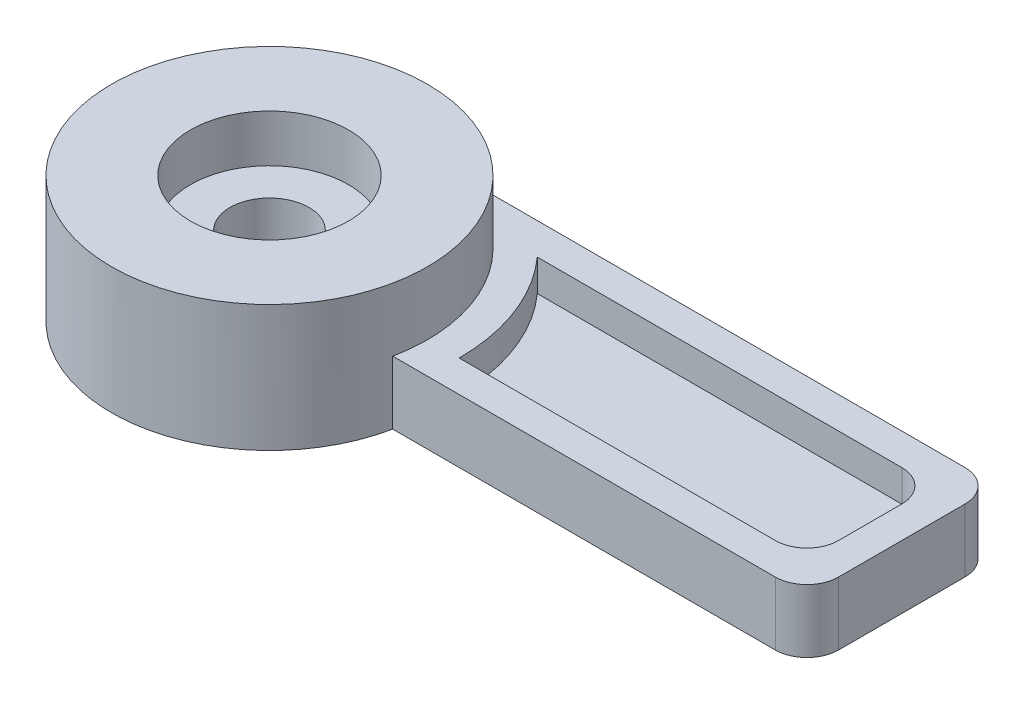
ISO-10303-21;
HEADER;
FILE_DESCRIPTION(('STEP AP214'),'2;1');
FILE_NAME('part.step','',(''),(''),'','','');
FILE_SCHEMA(('AUTOMOTIVE_DESIGN { 1 0 10303 214 1 1 1 1 }'));
ENDSEC;
DATA;
#1=APPLICATION_CONTEXT('core data for automotive mechanical design processes');
#2=APPLICATION_PROTOCOL_DEFINITION('international standard','automotive_design',2000,#1);
#3=PRODUCT_CONTEXT('',#1,'mechanical');
#4=PRODUCT('Part','Part','',(#3));
#5=PRODUCT_RELATED_PRODUCT_CATEGORY('part','',(#4));
#6=PRODUCT_DEFINITION_FORMATION('','',#4);
#7=PRODUCT_DEFINITION_CONTEXT('part definition',#1,'design');
#8=PRODUCT_DEFINITION('design','',#6,#7);
#9=PRODUCT_DEFINITION_SHAPE('','',#8);
#10=(LENGTH_UNIT() NAMED_UNIT(*) SI_UNIT(.MILLI.,.METRE.));
#11=(NAMED_UNIT(*) PLANE_ANGLE_UNIT() SI_UNIT($,.RADIAN.));
#12=(NAMED_UNIT(*) SI_UNIT($,.STERADIAN.) SOLID_ANGLE_UNIT());
#13=UNCERTAINTY_MEASURE_WITH_UNIT(LENGTH_MEASURE(1.E-05),#10,'distance_accuracy_value','');
#14=(GEOMETRIC_REPRESENTATION_CONTEXT(3) GLOBAL_UNCERTAINTY_ASSIGNED_CONTEXT((#13)) GLOBAL_UNIT_ASSIGNED_CONTEXT((#10,
#11,#12)) REPRESENTATION_CONTEXT('',''));
#15=CARTESIAN_POINT('',(0.,0.,0.));
#16=DIRECTION('',(0.,0.,1.));
#17=DIRECTION('',(1.,0.,0.));
#18=AXIS2_PLACEMENT_3D('',#15,#16,#17);
#19=CARTESIAN_POINT('',(0.,20.,0.));
#20=DIRECTION('',(0.,0.,1.));
#21=DIRECTION('',(1.,0.,0.));
#22=AXIS2_PLACEMENT_3D('',#19,#20,#21);
#23=PLANE('',#22);
#24=DIRECTION('',(-1.,0.,0.));
#25=VECTOR('',#24,1.);
#26=CARTESIAN_POINT('',(0.,20.,0.));
#27=LINE('',#26,#25);
#28=CARTESIAN_POINT('',(160.,20.,0.));
#29=VERTEX_POINT('',#28);
#30=CARTESIAN_POINT('',(60.,20.,0.));
#31=VERTEX_POINT('',#30);
#32=EDGE_CURVE('E260',#29,#31,#27,.T.);
#33=ORIENTED_EDGE('',*,*,#32,.F.);
#34=DIRECTION('',(0.,-1.,0.));
#35=VECTOR('',#34,1.);
#36=CARTESIAN_POINT('',(160.,10.,0.));
#37=LINE('',#36,#35);
#38=CARTESIAN_POINT('',(160.,10.,0.));
#39=VERTEX_POINT('',#38);
#40=EDGE_CURVE('E184',#29,#39,#37,.T.);
#41=ORIENTED_EDGE('',*,*,#40,.T.);
#42=DIRECTION('',(-1.,0.,0.));
#43=VECTOR('',#42,1.);
#44=CARTESIAN_POINT('',(170.,10.,0.));
#45=LINE('',#44,#43);
#46=CARTESIAN_POINT('',(60.,10.,0.));
#47=VERTEX_POINT('',#46);
#48=EDGE_CURVE('E276',#39,#47,#45,.T.);
#49=ORIENTED_EDGE('',*,*,#48,.T.);
#50=DIRECTION('',(0.,-1.,0.));
#51=VECTOR('',#50,1.);
#52=CARTESIAN_POINT('',(60.,20.,0.));
#53=LINE('',#52,#51);
#54=EDGE_CURVE('E140',#31,#47,#53,.T.);
#55=ORIENTED_EDGE('',*,*,#54,.F.);
#56=EDGE_LOOP('',(#33,#41,#49,#55));
#57=FACE_BOUND('',#56,.T.);
#58=ADVANCED_FACE('F35',(#57),#23,.F.);
#59=CARTESIAN_POINT('',(0.,20.,0.));
#60=DIRECTION('',(0.,-1.,0.));
#61=DIRECTION('',(0.,0.,-1.));
#62=AXIS2_PLACEMENT_3D('',#59,#60,#61);
#63=CYLINDRICAL_SURFACE('',#62,60.);
#64=ORIENTED_EDGE('',*,*,#54,.T.);
#65=CARTESIAN_POINT('',(0.,10.,0.));
#66=DIRECTION('',(0.,1.,0.));
#67=DIRECTION('',(0.,0.,1.));
#68=AXIS2_PLACEMENT_3D('',#65,#66,#67);
#69=CIRCLE('',#68,60.);
#70=CARTESIAN_POINT('',(44.7213595499958,10.,-40.));
#71=VERTEX_POINT('',#70);
#72=EDGE_CURVE('E126',#47,#71,#69,.T.);
#73=ORIENTED_EDGE('',*,*,#72,.T.);
#74=DIRECTION('',(0.,-1.,0.));
#75=VECTOR('',#74,1.);
#76=CARTESIAN_POINT('',(44.7213595499958,20.,-40.));
#77=LINE('',#76,#75);
#78=CARTESIAN_POINT('',(44.7213595499958,20.,-40.));
#79=VERTEX_POINT('',#78);
#80=EDGE_CURVE('E137',#79,#71,#77,.T.);
#81=ORIENTED_EDGE('',*,*,#80,.F.);
#82=CARTESIAN_POINT('',(0.,20.,0.));
#83=DIRECTION('',(0.,1.,0.));
#84=DIRECTION('',(0.,0.,1.));
#85=AXIS2_PLACEMENT_3D('',#82,#83,#84);
#86=CIRCLE('',#85,60.);
#87=EDGE_CURVE('E267',#31,#79,#86,.T.);
#88=ORIENTED_EDGE('',*,*,#87,.F.);
#89=EDGE_LOOP('',(#64,#73,#81,#88));
#90=FACE_BOUND('',#89,.T.);
#91=ADVANCED_FACE('F135',(#90),#63,.T.);
#92=CARTESIAN_POINT('',(0.,20.,-40.));
#93=DIRECTION('',(0.,0.,-1.));
#94=DIRECTION('',(-1.,0.,0.));
#95=AXIS2_PLACEMENT_3D('',#92,#93,#94);
#96=PLANE('',#95);
#97=DIRECTION('',(1.,0.,0.));
#98=VECTOR('',#97,1.);
#99=CARTESIAN_POINT('',(44.7213595499958,10.,-40.));
#100=LINE('',#99,#98);
#101=CARTESIAN_POINT('',(160.,10.,-40.));
#102=VERTEX_POINT('',#101);
#103=EDGE_CURVE('E122',#71,#102,#100,.T.);
#104=ORIENTED_EDGE('',*,*,#103,.T.);
#105=DIRECTION('',(0.,-1.,0.));
#106=VECTOR('',#105,1.);
#107=CARTESIAN_POINT('',(160.,20.,-40.));
#108=LINE('',#107,#106);
#109=CARTESIAN_POINT('',(160.,20.,-40.));
#110=VERTEX_POINT('',#109);
#111=EDGE_CURVE('E182',#102,#110,#108,.F.);
#112=ORIENTED_EDGE('',*,*,#111,.T.);
#113=DIRECTION('',(1.,0.,0.));
#114=VECTOR('',#113,1.);
#115=CARTESIAN_POINT('',(0.,20.,-40.));
#116=LINE('',#115,#114);
#117=EDGE_CURVE('E145',#79,#110,#116,.T.);
#118=ORIENTED_EDGE('',*,*,#117,.F.);
#119=ORIENTED_EDGE('',*,*,#80,.T.);
#120=EDGE_LOOP('',(#104,#112,#118,#119));
#121=FACE_BOUND('',#120,.T.);
#122=ADVANCED_FACE('F143',(#121),#96,.F.);
#123=CARTESIAN_POINT('',(0.,20.,10.));
#124=DIRECTION('',(0.,0.,1.));
#125=DIRECTION('',(1.,0.,0.));
#126=AXIS2_PLACEMENT_3D('',#123,#124,#125);
#127=PLANE('',#126);
#128=DIRECTION('',(-1.,0.,0.));
#129=VECTOR('',#128,1.);
#130=CARTESIAN_POINT('',(0.,0.,10.));
#131=LINE('',#130,#129);
#132=CARTESIAN_POINT('',(170.,0.,9.99999999999999));
#133=VERTEX_POINT('',#132);
#134=CARTESIAN_POINT('',(48.9897948556636,0.,10.));
#135=VERTEX_POINT('',#134);
#136=EDGE_CURVE('E235',#133,#135,#131,.T.);
#137=ORIENTED_EDGE('',*,*,#136,.F.);
#138=DIRECTION('',(0.,-1.,0.));
#139=VECTOR('',#138,1.);
#140=CARTESIAN_POINT('',(170.,20.,9.99999999999999));
#141=LINE('',#140,#139);
#142=CARTESIAN_POINT('',(170.,20.,9.99999999999999));
#143=VERTEX_POINT('',#142);
#144=EDGE_CURVE('E186',#133,#143,#141,.F.);
#145=ORIENTED_EDGE('',*,*,#144,.T.);
#146=DIRECTION('',(-1.,0.,0.));
#147=VECTOR('',#146,1.);
#148=CARTESIAN_POINT('',(0.,20.,10.));
#149=LINE('',#148,#147);
#150=CARTESIAN_POINT('',(48.9897948556636,20.,10.));
#151=VERTEX_POINT('',#150);
#152=EDGE_CURVE('E253',#143,#151,#149,.T.);
#153=ORIENTED_EDGE('',*,*,#152,.T.);
#154=DIRECTION('',(0.,-1.,0.));
#155=VECTOR('',#154,1.);
#156=CARTESIAN_POINT('',(48.9897948556636,20.,10.));
#157=LINE('',#156,#155);
#158=EDGE_CURVE('E146',#151,#135,#157,.T.);
#159=ORIENTED_EDGE('',*,*,#158,.T.);
#160=EDGE_LOOP('',(#137,#145,#153,#159));
#161=FACE_BOUND('',#160,.T.);
#162=ADVANCED_FACE('F227',(#161),#127,.T.);
#163=CARTESIAN_POINT('',(180.,20.,0.));
#164=DIRECTION('',(1.,0.,0.));
#165=DIRECTION('',(0.,0.,-1.));
#166=AXIS2_PLACEMENT_3D('',#163,#164,#165);
#167=PLANE('',#166);
#168=DIRECTION('',(0.,0.,1.));
#169=VECTOR('',#168,1.);
#170=CARTESIAN_POINT('',(180.,0.,0.));
#171=LINE('',#170,#169);
#172=CARTESIAN_POINT('',(180.,0.,-40.));
#173=VERTEX_POINT('',#172);
#174=CARTESIAN_POINT('',(180.,0.,0.));
#175=VERTEX_POINT('',#174);
#176=EDGE_CURVE('E241',#173,#175,#171,.T.);
#177=ORIENTED_EDGE('',*,*,#176,.F.);
#178=DIRECTION('',(0.,-1.,0.));
#179=VECTOR('',#178,1.);
#180=CARTESIAN_POINT('',(180.,20.,-40.));
#181=LINE('',#180,#179);
#182=CARTESIAN_POINT('',(180.,20.,-40.));
#183=VERTEX_POINT('',#182);
#184=EDGE_CURVE('E169',#173,#183,#181,.F.);
#185=ORIENTED_EDGE('',*,*,#184,.T.);
#186=DIRECTION('',(0.,0.,1.));
#187=VECTOR('',#186,1.);
#188=CARTESIAN_POINT('',(180.,20.,0.));
#189=LINE('',#188,#187);
#190=CARTESIAN_POINT('',(180.,20.,0.));
#191=VERTEX_POINT('',#190);
#192=EDGE_CURVE('E250',#183,#191,#189,.T.);
#193=ORIENTED_EDGE('',*,*,#192,.T.);
#194=DIRECTION('',(0.,-1.,0.));
#195=VECTOR('',#194,1.);
#196=CARTESIAN_POINT('',(180.,20.,0.));
#197=LINE('',#196,#195);
#198=EDGE_CURVE('E166',#191,#175,#197,.T.);
#199=ORIENTED_EDGE('',*,*,#198,.T.);
#200=EDGE_LOOP('',(#177,#185,#193,#199));
#201=FACE_BOUND('',#200,.T.);
#202=ADVANCED_FACE('F223',(#201),#167,.T.);
#203=CARTESIAN_POINT('',(0.,20.,-50.));
#204=DIRECTION('',(0.,0.,-1.));
#205=DIRECTION('',(-1.,0.,0.));
#206=AXIS2_PLACEMENT_3D('',#203,#204,#205);
#207=PLANE('',#206);
#208=DIRECTION('',(1.,0.,0.));
#209=VECTOR('',#208,1.);
#210=CARTESIAN_POINT('',(0.,20.,-50.));
#211=LINE('',#210,#209);
#212=CARTESIAN_POINT('',(0.,20.,-50.));
#213=VERTEX_POINT('',#212);
#214=CARTESIAN_POINT('',(170.,20.,-50.));
#215=VERTEX_POINT('',#214);
#216=EDGE_CURVE('E257',#213,#215,#211,.T.);
#217=ORIENTED_EDGE('',*,*,#216,.T.);
#218=DIRECTION('',(0.,-1.,0.));
#219=VECTOR('',#218,1.);
#220=CARTESIAN_POINT('',(170.,20.,-50.));
#221=LINE('',#220,#219);
#222=CARTESIAN_POINT('',(170.,0.,-50.));
#223=VERTEX_POINT('',#222);
#224=EDGE_CURVE('E148',#215,#223,#221,.T.);
#225=ORIENTED_EDGE('',*,*,#224,.T.);
#226=DIRECTION('',(1.,0.,0.));
#227=VECTOR('',#226,1.);
#228=CARTESIAN_POINT('',(0.,0.,-50.));
#229=LINE('',#228,#227);
#230=CARTESIAN_POINT('',(0.,0.,-50.));
#231=VERTEX_POINT('',#230);
#232=EDGE_CURVE('E154',#231,#223,#229,.T.);
#233=ORIENTED_EDGE('',*,*,#232,.F.);
#234=DIRECTION('',(0.,-1.,0.));
#235=VECTOR('',#234,1.);
#236=CARTESIAN_POINT('',(0.,20.,-50.));
#237=LINE('',#236,#235);
#238=EDGE_CURVE('E151',#213,#231,#237,.T.);
#239=ORIENTED_EDGE('',*,*,#238,.F.);
#240=EDGE_LOOP('',(#217,#225,#233,#239));
#241=FACE_BOUND('',#240,.T.);
#242=ADVANCED_FACE('F220',(#241),#207,.T.);
#243=CARTESIAN_POINT('',(170.,20.,0.));
#244=DIRECTION('',(1.,0.,0.));
#245=DIRECTION('',(0.,0.,-1.));
#246=AXIS2_PLACEMENT_3D('',#243,#244,#245);
#247=PLANE('',#246);
#248=DIRECTION('',(0.,0.,1.));
#249=VECTOR('',#248,1.);
#250=CARTESIAN_POINT('',(170.,20.,0.));
#251=LINE('',#250,#249);
#252=CARTESIAN_POINT('',(170.,20.,-30.));
#253=VERTEX_POINT('',#252);
#254=CARTESIAN_POINT('',(170.,20.,-10.));
#255=VERTEX_POINT('',#254);
#256=EDGE_CURVE('E158',#253,#255,#251,.T.);
#257=ORIENTED_EDGE('',*,*,#256,.F.);
#258=DIRECTION('',(0.,-1.,0.));
#259=VECTOR('',#258,1.);
#260=CARTESIAN_POINT('',(170.,10.,-30.));
#261=LINE('',#260,#259);
#262=CARTESIAN_POINT('',(170.,10.,-30.));
#263=VERTEX_POINT('',#262);
#264=EDGE_CURVE('E177',#253,#263,#261,.T.);
#265=ORIENTED_EDGE('',*,*,#264,.T.);
#266=DIRECTION('',(0.,0.,1.));
#267=VECTOR('',#266,1.);
#268=CARTESIAN_POINT('',(170.,10.,-40.));
#269=LINE('',#268,#267);
#270=CARTESIAN_POINT('',(170.,10.,-10.));
#271=VERTEX_POINT('',#270);
#272=EDGE_CURVE('E131',#263,#271,#269,.T.);
#273=ORIENTED_EDGE('',*,*,#272,.T.);
#274=DIRECTION('',(0.,-1.,0.));
#275=VECTOR('',#274,1.);
#276=CARTESIAN_POINT('',(170.,20.,-10.));
#277=LINE('',#276,#275);
#278=EDGE_CURVE('E175',#271,#255,#277,.F.);
#279=ORIENTED_EDGE('',*,*,#278,.T.);
#280=EDGE_LOOP('',(#257,#265,#273,#279));
#281=FACE_BOUND('',#280,.T.);
#282=ADVANCED_FACE('F196',(#281),#247,.F.);
#283=CARTESIAN_POINT('',(0.,20.,0.));
#284=DIRECTION('',(0.,1.,0.));
#285=DIRECTION('',(0.,0.,1.));
#286=AXIS2_PLACEMENT_3D('',#283,#284,#285);
#287=PLANE('',#286);
#288=ORIENTED_EDGE('',*,*,#192,.F.);
#289=CARTESIAN_POINT('',(170.,20.,-40.));
#290=DIRECTION('',(0.,1.,0.));
#291=DIRECTION('',(0.,0.,1.));
#292=AXIS2_PLACEMENT_3D('',#289,#290,#291);
#293=CIRCLE('',#292,10.);
#294=EDGE_CURVE('E173',#183,#215,#293,.T.);
#295=ORIENTED_EDGE('',*,*,#294,.T.);
#296=ORIENTED_EDGE('',*,*,#216,.F.);
#297=CARTESIAN_POINT('',(0.,20.,0.));
#298=DIRECTION('',(0.,1.,0.));
#299=DIRECTION('',(0.,0.,1.));
#300=AXIS2_PLACEMENT_3D('',#297,#298,#299);
#301=CIRCLE('',#300,50.);
#302=EDGE_CURVE('E262',#151,#213,#301,.T.);
#303=ORIENTED_EDGE('',*,*,#302,.F.);
#304=ORIENTED_EDGE('',*,*,#152,.F.);
#305=CARTESIAN_POINT('',(170.,20.,0.));
#306=DIRECTION('',(0.,1.,0.));
#307=DIRECTION('',(0.,0.,1.));
#308=AXIS2_PLACEMENT_3D('',#305,#306,#307);
#309=CIRCLE('',#308,10.);
#310=EDGE_CURVE('E171',#143,#191,#309,.T.);
#311=ORIENTED_EDGE('',*,*,#310,.T.);
#312=EDGE_LOOP('',(#288,#295,#296,#303,#304,#311));
#313=FACE_BOUND('',#312,.T.);
#314=ORIENTED_EDGE('',*,*,#256,.T.);
#315=CARTESIAN_POINT('',(160.,20.,-10.));
#316=DIRECTION('',(0.,1.,0.));
#317=DIRECTION('',(0.,0.,1.));
#318=AXIS2_PLACEMENT_3D('',#315,#316,#317);
#319=CIRCLE('',#318,10.);
#320=EDGE_CURVE('E11',#255,#29,#319,.F.);
#321=ORIENTED_EDGE('',*,*,#320,.T.);
#322=ORIENTED_EDGE('',*,*,#32,.T.);
#323=ORIENTED_EDGE('',*,*,#87,.T.);
#324=ORIENTED_EDGE('',*,*,#117,.T.);
#325=CARTESIAN_POINT('',(160.,20.,-30.));
#326=DIRECTION('',(0.,1.,0.));
#327=DIRECTION('',(0.,0.,1.));
#328=AXIS2_PLACEMENT_3D('',#325,#326,#327);
#329=CIRCLE('',#328,10.);
#330=EDGE_CURVE('E43',#110,#253,#329,.F.);
#331=ORIENTED_EDGE('',*,*,#330,.T.);
#332=EDGE_LOOP('',(#314,#321,#322,#323,#324,#331));
#333=FACE_BOUND('',#332,.T.);
#334=ADVANCED_FACE('F191',(#313,#333),#287,.T.);
#335=CARTESIAN_POINT('',(0.,0.,0.));
#336=DIRECTION('',(0.,1.,0.));
#337=DIRECTION('',(0.,0.,1.));
#338=AXIS2_PLACEMENT_3D('',#335,#336,#337);
#339=PLANE('',#338);
#340=CARTESIAN_POINT('',(0.,0.,0.));
#341=DIRECTION('',(0.,1.,0.));
#342=DIRECTION('',(0.,0.,1.));
#343=AXIS2_PLACEMENT_3D('',#340,#341,#342);
#344=CIRCLE('',#343,12.5);
#345=CARTESIAN_POINT('',(0.,0.,12.5));
#346=VERTEX_POINT('',#345);
#347=EDGE_CURVE('E141',#346,#346,#344,.T.);
#348=ORIENTED_EDGE('',*,*,#347,.T.);
#349=EDGE_LOOP('',(#348));
#350=FACE_BOUND('',#349,.T.);
#351=ORIENTED_EDGE('',*,*,#232,.T.);
#352=CARTESIAN_POINT('',(170.,0.,-40.));
#353=DIRECTION('',(0.,1.,0.));
#354=DIRECTION('',(0.,0.,1.));
#355=AXIS2_PLACEMENT_3D('',#352,#353,#354);
#356=CIRCLE('',#355,10.);
#357=EDGE_CURVE('E164',#223,#173,#356,.F.);
#358=ORIENTED_EDGE('',*,*,#357,.T.);
#359=ORIENTED_EDGE('',*,*,#176,.T.);
#360=CARTESIAN_POINT('',(170.,0.,0.));
#361=DIRECTION('',(0.,1.,0.));
#362=DIRECTION('',(0.,0.,1.));
#363=AXIS2_PLACEMENT_3D('',#360,#361,#362);
#364=CIRCLE('',#363,10.);
#365=EDGE_CURVE('E162',#175,#133,#364,.F.);
#366=ORIENTED_EDGE('',*,*,#365,.T.);
#367=ORIENTED_EDGE('',*,*,#136,.T.);
#368=CARTESIAN_POINT('',(0.,0.,0.));
#369=DIRECTION('',(0.,1.,0.));
#370=DIRECTION('',(0.,0.,1.));
#371=AXIS2_PLACEMENT_3D('',#368,#369,#370);
#372=CIRCLE('',#371,50.);
#373=EDGE_CURVE('E274',#231,#135,#372,.T.);
#374=ORIENTED_EDGE('',*,*,#373,.F.);
#375=EDGE_LOOP('',(#351,#358,#359,#366,#367,#374));
#376=FACE_BOUND('',#375,.T.);
#377=ADVANCED_FACE('F303',(#350,#376),#339,.F.);
#378=CARTESIAN_POINT('',(0.,40.,0.));
#379=DIRECTION('',(0.,-1.,0.));
#380=DIRECTION('',(0.,0.,-1.));
#381=AXIS2_PLACEMENT_3D('',#378,#379,#380);
#382=CYLINDRICAL_SURFACE('',#381,50.);
#383=ORIENTED_EDGE('',*,*,#158,.F.);
#384=ORIENTED_EDGE('',*,*,#302,.T.);
#385=ORIENTED_EDGE('',*,*,#238,.T.);
#386=ORIENTED_EDGE('',*,*,#373,.T.);
#387=EDGE_LOOP('',(#383,#384,#385,#386));
#388=FACE_BOUND('',#387,.T.);
#389=CARTESIAN_POINT('',(0.,40.,0.));
#390=DIRECTION('',(0.,1.,0.));
#391=DIRECTION('',(0.,0.,1.));
#392=AXIS2_PLACEMENT_3D('',#389,#390,#391);
#393=CIRCLE('',#392,50.);
#394=CARTESIAN_POINT('',(0.,40.,50.));
#395=VERTEX_POINT('',#394);
#396=EDGE_CURVE('E242',#395,#395,#393,.T.);
#397=ORIENTED_EDGE('',*,*,#396,.F.);
#398=EDGE_LOOP('',(#397));
#399=FACE_BOUND('',#398,.T.);
#400=ADVANCED_FACE('F298',(#388,#399),#382,.T.);
#401=CARTESIAN_POINT('',(0.,40.,0.));
#402=DIRECTION('',(0.,1.,0.));
#403=DIRECTION('',(0.,0.,1.));
#404=AXIS2_PLACEMENT_3D('',#401,#402,#403);
#405=PLANE('',#404);
#406=CARTESIAN_POINT('',(0.,40.,0.));
#407=DIRECTION('',(0.,1.,0.));
#408=DIRECTION('',(0.,0.,1.));
#409=AXIS2_PLACEMENT_3D('',#406,#407,#408);
#410=CIRCLE('',#409,25.);
#411=CARTESIAN_POINT('',(0.,40.,25.));
#412=VERTEX_POINT('',#411);
#413=EDGE_CURVE('E289',#412,#412,#410,.T.);
#414=ORIENTED_EDGE('',*,*,#413,.F.);
#415=EDGE_LOOP('',(#414));
#416=FACE_BOUND('',#415,.T.);
#417=ORIENTED_EDGE('',*,*,#396,.T.);
#418=EDGE_LOOP('',(#417));
#419=FACE_BOUND('',#418,.T.);
#420=ADVANCED_FACE('F295',(#416,#419),#405,.T.);
#421=CARTESIAN_POINT('',(0.,10.,0.));
#422=DIRECTION('',(0.,1.,0.));
#423=DIRECTION('',(0.,0.,1.));
#424=AXIS2_PLACEMENT_3D('',#421,#422,#423);
#425=PLANE('',#424);
#426=ORIENTED_EDGE('',*,*,#272,.F.);
#427=CARTESIAN_POINT('',(160.,10.,-30.));
#428=DIRECTION('',(0.,1.,0.));
#429=DIRECTION('',(0.,0.,1.));
#430=AXIS2_PLACEMENT_3D('',#427,#428,#429);
#431=CIRCLE('',#430,10.);
#432=EDGE_CURVE('E50',#263,#102,#431,.T.);
#433=ORIENTED_EDGE('',*,*,#432,.T.);
#434=ORIENTED_EDGE('',*,*,#103,.F.);
#435=ORIENTED_EDGE('',*,*,#72,.F.);
#436=ORIENTED_EDGE('',*,*,#48,.F.);
#437=CARTESIAN_POINT('',(160.,10.,-10.));
#438=DIRECTION('',(0.,1.,0.));
#439=DIRECTION('',(0.,0.,1.));
#440=AXIS2_PLACEMENT_3D('',#437,#438,#439);
#441=CIRCLE('',#440,10.);
#442=EDGE_CURVE('E58',#39,#271,#441,.T.);
#443=ORIENTED_EDGE('',*,*,#442,.T.);
#444=EDGE_LOOP('',(#426,#433,#434,#435,#436,#443));
#445=FACE_BOUND('',#444,.T.);
#446=ADVANCED_FACE('F124',(#445),#425,.T.);
#447=CARTESIAN_POINT('',(170.,20.,-40.));
#448=DIRECTION('',(0.,-1.,0.));
#449=DIRECTION('',(0.,0.,-1.));
#450=AXIS2_PLACEMENT_3D('',#447,#448,#449);
#451=CYLINDRICAL_SURFACE('',#450,10.);
#452=ORIENTED_EDGE('',*,*,#294,.F.);
#453=ORIENTED_EDGE('',*,*,#184,.F.);
#454=ORIENTED_EDGE('',*,*,#357,.F.);
#455=ORIENTED_EDGE('',*,*,#224,.F.);
#456=EDGE_LOOP('',(#452,#453,#454,#455));
#457=FACE_BOUND('',#456,.T.);
#458=ADVANCED_FACE('F202',(#457),#451,.T.);
#459=CARTESIAN_POINT('',(160.,20.,-30.));
#460=DIRECTION('',(0.,1.,0.));
#461=DIRECTION('',(0.,0.,1.));
#462=AXIS2_PLACEMENT_3D('',#459,#460,#461);
#463=CYLINDRICAL_SURFACE('',#462,10.);
#464=ORIENTED_EDGE('',*,*,#330,.F.);
#465=ORIENTED_EDGE('',*,*,#111,.F.);
#466=ORIENTED_EDGE('',*,*,#432,.F.);
#467=ORIENTED_EDGE('',*,*,#264,.F.);
#468=EDGE_LOOP('',(#464,#465,#466,#467));
#469=FACE_BOUND('',#468,.T.);
#470=ADVANCED_FACE('F199',(#469),#463,.F.);
#471=CARTESIAN_POINT('',(160.,20.,-10.));
#472=DIRECTION('',(0.,1.,0.));
#473=DIRECTION('',(0.,0.,1.));
#474=AXIS2_PLACEMENT_3D('',#471,#472,#473);
#475=CYLINDRICAL_SURFACE('',#474,10.);
#476=ORIENTED_EDGE('',*,*,#320,.F.);
#477=ORIENTED_EDGE('',*,*,#278,.F.);
#478=ORIENTED_EDGE('',*,*,#442,.F.);
#479=ORIENTED_EDGE('',*,*,#40,.F.);
#480=EDGE_LOOP('',(#476,#477,#478,#479));
#481=FACE_BOUND('',#480,.T.);
#482=ADVANCED_FACE('F201',(#481),#475,.F.);
#483=CARTESIAN_POINT('',(170.,20.,0.));
#484=DIRECTION('',(0.,-1.,0.));
#485=DIRECTION('',(0.,0.,-1.));
#486=AXIS2_PLACEMENT_3D('',#483,#484,#485);
#487=CYLINDRICAL_SURFACE('',#486,10.);
#488=ORIENTED_EDGE('',*,*,#310,.F.);
#489=ORIENTED_EDGE('',*,*,#144,.F.);
#490=ORIENTED_EDGE('',*,*,#365,.F.);
#491=ORIENTED_EDGE('',*,*,#198,.F.);
#492=EDGE_LOOP('',(#488,#489,#490,#491));
#493=FACE_BOUND('',#492,.T.);
#494=ADVANCED_FACE('F37',(#493),#487,.T.);
#495=CARTESIAN_POINT('',(0.,40.,0.));
#496=DIRECTION('',(0.,1.,0.));
#497=DIRECTION('',(0.,0.,1.));
#498=AXIS2_PLACEMENT_3D('',#495,#496,#497);
#499=CYLINDRICAL_SURFACE('',#498,12.5);
#500=ORIENTED_EDGE('',*,*,#347,.F.);
#501=EDGE_LOOP('',(#500));
#502=FACE_BOUND('',#501,.T.);
#503=CARTESIAN_POINT('',(0.,25.,0.));
#504=DIRECTION('',(0.,1.,0.));
#505=DIRECTION('',(0.,0.,1.));
#506=AXIS2_PLACEMENT_3D('',#503,#504,#505);
#507=CIRCLE('',#506,12.5);
#508=CARTESIAN_POINT('',(0.,25.,12.5));
#509=VERTEX_POINT('',#508);
#510=EDGE_CURVE('E283',#509,#509,#507,.T.);
#511=ORIENTED_EDGE('',*,*,#510,.T.);
#512=EDGE_LOOP('',(#511));
#513=FACE_BOUND('',#512,.T.);
#514=ADVANCED_FACE('F348',(#502,#513),#499,.F.);
#515=CARTESIAN_POINT('',(12.5,25.,0.));
#516=DIRECTION('',(0.,-1.,0.));
#517=DIRECTION('',(0.,0.,-1.));
#518=AXIS2_PLACEMENT_3D('',#515,#516,#517);
#519=PLANE('',#518);
#520=ORIENTED_EDGE('',*,*,#510,.F.);
#521=EDGE_LOOP('',(#520));
#522=FACE_BOUND('',#521,.T.);
#523=CARTESIAN_POINT('',(0.,25.,0.));
#524=DIRECTION('',(0.,1.,0.));
#525=DIRECTION('',(0.,0.,1.));
#526=AXIS2_PLACEMENT_3D('',#523,#524,#525);
#527=CIRCLE('',#526,25.);
#528=CARTESIAN_POINT('',(0.,25.,25.));
#529=VERTEX_POINT('',#528);
#530=EDGE_CURVE('E286',#529,#529,#527,.T.);
#531=ORIENTED_EDGE('',*,*,#530,.T.);
#532=EDGE_LOOP('',(#531));
#533=FACE_BOUND('',#532,.T.);
#534=ADVANCED_FACE('F353',(#522,#533),#519,.F.);
#535=CARTESIAN_POINT('',(0.,40.,0.));
#536=DIRECTION('',(0.,1.,0.));
#537=DIRECTION('',(0.,0.,1.));
#538=AXIS2_PLACEMENT_3D('',#535,#536,#537);
#539=CYLINDRICAL_SURFACE('',#538,25.);
#540=ORIENTED_EDGE('',*,*,#530,.F.);
#541=EDGE_LOOP('',(#540));
#542=FACE_BOUND('',#541,.T.);
#543=ORIENTED_EDGE('',*,*,#413,.T.);
#544=EDGE_LOOP('',(#543));
#545=FACE_BOUND('',#544,.T.);
#546=ADVANCED_FACE('F293',(#542,#545),#539,.F.);
#547=CLOSED_SHELL('',(#58,#91,#122,#162,#202,#242,#282,#334,#377,#400,#420,#446,#458,#470,#482,
#494,#514,#534,#546));
#548=MANIFOLD_SOLID_BREP('B2',#547);
#549=ADVANCED_BREP_SHAPE_REPRESENTATION('',(#18,#548),#14);
#550=SHAPE_DEFINITION_REPRESENTATION(#9,#549);
ENDSEC;
END-ISO-10303-21;
